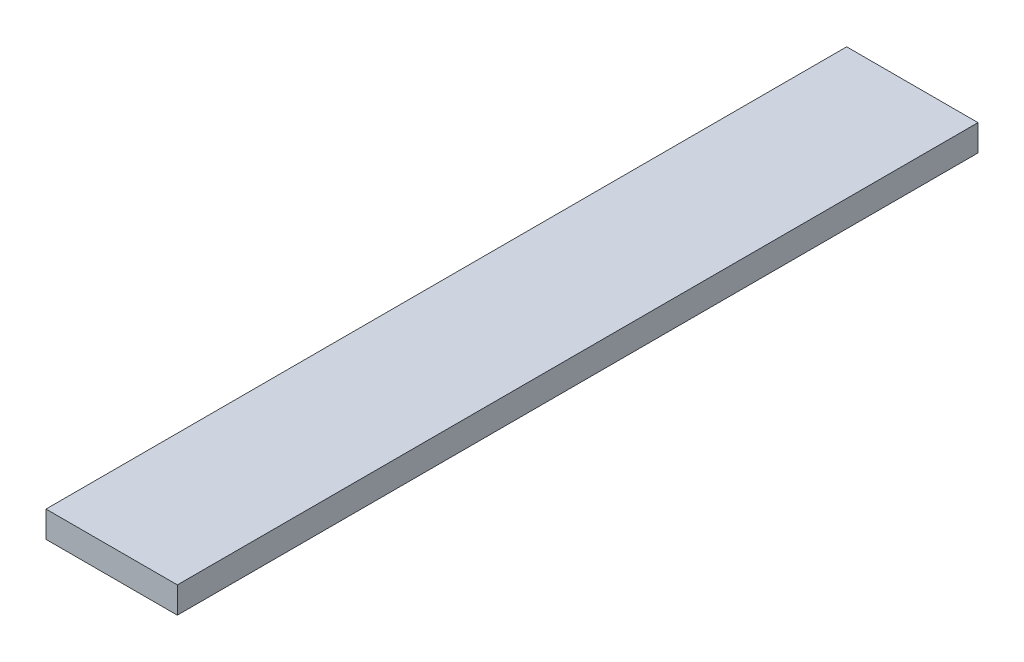
ISO-10303-21;
HEADER;
FILE_DESCRIPTION(('STEP AP214'),'2;1');
FILE_NAME('part.step','',(''),(''),'','','');
FILE_SCHEMA(('AUTOMOTIVE_DESIGN { 1 0 10303 214 1 1 1 1 }'));
ENDSEC;
DATA;
#1=APPLICATION_CONTEXT('core data for automotive mechanical design processes');
#2=APPLICATION_PROTOCOL_DEFINITION('international standard','automotive_design',2000,#1);
#3=PRODUCT_CONTEXT('',#1,'mechanical');
#4=PRODUCT('Part','Part','',(#3));
#5=PRODUCT_RELATED_PRODUCT_CATEGORY('part','',(#4));
#6=PRODUCT_DEFINITION_FORMATION('','',#4);
#7=PRODUCT_DEFINITION_CONTEXT('part definition',#1,'design');
#8=PRODUCT_DEFINITION('design','',#6,#7);
#9=PRODUCT_DEFINITION_SHAPE('','',#8);
#10=(LENGTH_UNIT() NAMED_UNIT(*) SI_UNIT(.MILLI.,.METRE.));
#11=(NAMED_UNIT(*) PLANE_ANGLE_UNIT() SI_UNIT($,.RADIAN.));
#12=(NAMED_UNIT(*) SI_UNIT($,.STERADIAN.) SOLID_ANGLE_UNIT());
#13=UNCERTAINTY_MEASURE_WITH_UNIT(LENGTH_MEASURE(1.E-05),#10,'distance_accuracy_value','');
#14=(GEOMETRIC_REPRESENTATION_CONTEXT(3) GLOBAL_UNCERTAINTY_ASSIGNED_CONTEXT((#13)) GLOBAL_UNIT_ASSIGNED_CONTEXT((#10,
#11,#12)) REPRESENTATION_CONTEXT('',''));
#15=CARTESIAN_POINT('',(0.,0.,0.));
#16=DIRECTION('',(0.,0.,1.));
#17=DIRECTION('',(1.,0.,0.));
#18=AXIS2_PLACEMENT_3D('',#15,#16,#17);
#19=CARTESIAN_POINT('',(-25.,-5.,152.4));
#20=DIRECTION('',(1.,0.,0.));
#21=DIRECTION('',(0.,0.,-1.));
#22=AXIS2_PLACEMENT_3D('',#19,#20,#21);
#23=PLANE('',#22);
#24=DIRECTION('',(0.,-1.,0.));
#25=VECTOR('',#24,1.);
#26=CARTESIAN_POINT('',(-25.,-5.,-152.4));
#27=LINE('',#26,#25);
#28=CARTESIAN_POINT('',(-25.,5.,-152.4));
#29=VERTEX_POINT('',#28);
#30=CARTESIAN_POINT('',(-25.,-5.,-152.4));
#31=VERTEX_POINT('',#30);
#32=EDGE_CURVE('E102',#29,#31,#27,.T.);
#33=ORIENTED_EDGE('',*,*,#32,.T.);
#34=DIRECTION('',(0.,0.,-1.));
#35=VECTOR('',#34,1.);
#36=CARTESIAN_POINT('',(-25.,-5.,152.4));
#37=LINE('',#36,#35);
#38=CARTESIAN_POINT('',(-25.,-5.,152.4));
#39=VERTEX_POINT('',#38);
#40=EDGE_CURVE('E11',#39,#31,#37,.T.);
#41=ORIENTED_EDGE('',*,*,#40,.F.);
#42=DIRECTION('',(0.,-1.,0.));
#43=VECTOR('',#42,1.);
#44=CARTESIAN_POINT('',(-25.,-5.,152.4));
#45=LINE('',#44,#43);
#46=CARTESIAN_POINT('',(-25.,5.,152.4));
#47=VERTEX_POINT('',#46);
#48=EDGE_CURVE('E90',#47,#39,#45,.T.);
#49=ORIENTED_EDGE('',*,*,#48,.F.);
#50=DIRECTION('',(0.,0.,-1.));
#51=VECTOR('',#50,1.);
#52=CARTESIAN_POINT('',(-25.,5.,152.4));
#53=LINE('',#52,#51);
#54=EDGE_CURVE('E98',#47,#29,#53,.T.);
#55=ORIENTED_EDGE('',*,*,#54,.T.);
#56=EDGE_LOOP('',(#33,#41,#49,#55));
#57=FACE_BOUND('',#56,.T.);
#58=ADVANCED_FACE('F39',(#57),#23,.F.);
#59=CARTESIAN_POINT('',(25.,-5.,152.4));
#60=DIRECTION('',(0.,1.,0.));
#61=DIRECTION('',(0.,0.,1.));
#62=AXIS2_PLACEMENT_3D('',#59,#60,#61);
#63=PLANE('',#62);
#64=DIRECTION('',(1.,0.,0.));
#65=VECTOR('',#64,1.);
#66=CARTESIAN_POINT('',(25.,-5.,-152.4));
#67=LINE('',#66,#65);
#68=CARTESIAN_POINT('',(25.,-5.,-152.4));
#69=VERTEX_POINT('',#68);
#70=EDGE_CURVE('E94',#31,#69,#67,.T.);
#71=ORIENTED_EDGE('',*,*,#70,.T.);
#72=DIRECTION('',(0.,0.,-1.));
#73=VECTOR('',#72,1.);
#74=CARTESIAN_POINT('',(25.,-5.,152.4));
#75=LINE('',#74,#73);
#76=CARTESIAN_POINT('',(25.,-5.,152.4));
#77=VERTEX_POINT('',#76);
#78=EDGE_CURVE('E47',#77,#69,#75,.T.);
#79=ORIENTED_EDGE('',*,*,#78,.F.);
#80=DIRECTION('',(1.,0.,0.));
#81=VECTOR('',#80,1.);
#82=CARTESIAN_POINT('',(25.,-5.,152.4));
#83=LINE('',#82,#81);
#84=EDGE_CURVE('E85',#39,#77,#83,.T.);
#85=ORIENTED_EDGE('',*,*,#84,.F.);
#86=ORIENTED_EDGE('',*,*,#40,.T.);
#87=EDGE_LOOP('',(#71,#79,#85,#86));
#88=FACE_BOUND('',#87,.T.);
#89=ADVANCED_FACE('F93',(#88),#63,.F.);
#90=CARTESIAN_POINT('',(25.,5.00000000000001,152.4));
#91=DIRECTION('',(-1.,0.,0.));
#92=DIRECTION('',(0.,0.,1.));
#93=AXIS2_PLACEMENT_3D('',#90,#91,#92);
#94=PLANE('',#93);
#95=DIRECTION('',(0.,1.,0.));
#96=VECTOR('',#95,1.);
#97=CARTESIAN_POINT('',(25.,5.00000000000001,-152.4));
#98=LINE('',#97,#96);
#99=CARTESIAN_POINT('',(25.,5.00000000000001,-152.4));
#100=VERTEX_POINT('',#99);
#101=EDGE_CURVE('E72',#69,#100,#98,.T.);
#102=ORIENTED_EDGE('',*,*,#101,.T.);
#103=DIRECTION('',(0.,0.,-1.));
#104=VECTOR('',#103,1.);
#105=CARTESIAN_POINT('',(25.,5.00000000000001,152.4));
#106=LINE('',#105,#104);
#107=CARTESIAN_POINT('',(25.,5.00000000000001,152.4));
#108=VERTEX_POINT('',#107);
#109=EDGE_CURVE('E95',#108,#100,#106,.T.);
#110=ORIENTED_EDGE('',*,*,#109,.F.);
#111=DIRECTION('',(0.,1.,0.));
#112=VECTOR('',#111,1.);
#113=CARTESIAN_POINT('',(25.,5.00000000000001,152.4));
#114=LINE('',#113,#112);
#115=EDGE_CURVE('E88',#77,#108,#114,.T.);
#116=ORIENTED_EDGE('',*,*,#115,.F.);
#117=ORIENTED_EDGE('',*,*,#78,.T.);
#118=EDGE_LOOP('',(#102,#110,#116,#117));
#119=FACE_BOUND('',#118,.T.);
#120=ADVANCED_FACE('F96',(#119),#94,.F.);
#121=CARTESIAN_POINT('',(-25.,5.,152.4));
#122=DIRECTION('',(0.,-1.,0.));
#123=DIRECTION('',(1.,0.,0.));
#124=AXIS2_PLACEMENT_3D('',#121,#122,#123);
#125=PLANE('',#124);
#126=DIRECTION('',(-1.,0.,0.));
#127=VECTOR('',#126,1.);
#128=CARTESIAN_POINT('',(-25.,5.,-152.4));
#129=LINE('',#128,#127);
#130=EDGE_CURVE('E78',#100,#29,#129,.T.);
#131=ORIENTED_EDGE('',*,*,#130,.T.);
#132=ORIENTED_EDGE('',*,*,#54,.F.);
#133=DIRECTION('',(-1.,0.,0.));
#134=VECTOR('',#133,1.);
#135=CARTESIAN_POINT('',(-25.,5.,152.4));
#136=LINE('',#135,#134);
#137=EDGE_CURVE('E55',#108,#47,#136,.T.);
#138=ORIENTED_EDGE('',*,*,#137,.F.);
#139=ORIENTED_EDGE('',*,*,#109,.T.);
#140=EDGE_LOOP('',(#131,#132,#138,#139));
#141=FACE_BOUND('',#140,.T.);
#142=ADVANCED_FACE('F109',(#141),#125,.F.);
#143=CARTESIAN_POINT('',(0.,0.,152.4));
#144=DIRECTION('',(0.,0.,-1.));
#145=DIRECTION('',(-1.,0.,0.));
#146=AXIS2_PLACEMENT_3D('',#143,#144,#145);
#147=PLANE('',#146);
#148=ORIENTED_EDGE('',*,*,#48,.T.);
#149=ORIENTED_EDGE('',*,*,#84,.T.);
#150=ORIENTED_EDGE('',*,*,#115,.T.);
#151=ORIENTED_EDGE('',*,*,#137,.T.);
#152=EDGE_LOOP('',(#148,#149,#150,#151));
#153=FACE_BOUND('',#152,.T.);
#154=ADVANCED_FACE('F86',(#153),#147,.F.);
#155=CARTESIAN_POINT('',(0.,0.,-152.4));
#156=DIRECTION('',(0.,0.,-1.));
#157=DIRECTION('',(-1.,0.,0.));
#158=AXIS2_PLACEMENT_3D('',#155,#156,#157);
#159=PLANE('',#158);
#160=ORIENTED_EDGE('',*,*,#32,.F.);
#161=ORIENTED_EDGE('',*,*,#130,.F.);
#162=ORIENTED_EDGE('',*,*,#101,.F.);
#163=ORIENTED_EDGE('',*,*,#70,.F.);
#164=EDGE_LOOP('',(#160,#161,#162,#163));
#165=FACE_BOUND('',#164,.T.);
#166=ADVANCED_FACE('F112',(#165),#159,.T.);
#167=CLOSED_SHELL('',(#58,#89,#120,#142,#154,#166));
#168=MANIFOLD_SOLID_BREP('B2',#167);
#169=ADVANCED_BREP_SHAPE_REPRESENTATION('',(#18,#168),#14);
#170=SHAPE_DEFINITION_REPRESENTATION(#9,#169);
ENDSEC;
END-ISO-10303-21;
